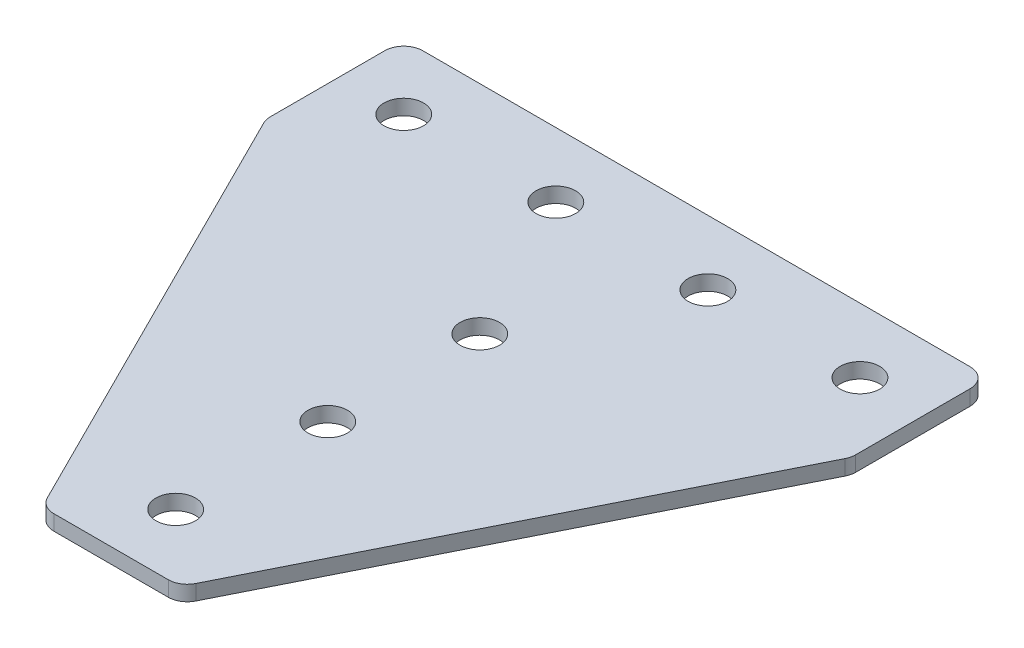
ISO-10303-21;
HEADER;
FILE_DESCRIPTION(('STEP AP214'),'2;1');
FILE_NAME('part.step','',(''),(''),'','','');
FILE_SCHEMA(('AUTOMOTIVE_DESIGN { 1 0 10303 214 1 1 1 1 }'));
ENDSEC;
DATA;
#1=APPLICATION_CONTEXT('core data for automotive mechanical design processes');
#2=APPLICATION_PROTOCOL_DEFINITION('international standard','automotive_design',2000,#1);
#3=PRODUCT_CONTEXT('',#1,'mechanical');
#4=PRODUCT('Part','Part','',(#3));
#5=PRODUCT_RELATED_PRODUCT_CATEGORY('part','',(#4));
#6=PRODUCT_DEFINITION_FORMATION('','',#4);
#7=PRODUCT_DEFINITION_CONTEXT('part definition',#1,'design');
#8=PRODUCT_DEFINITION('design','',#6,#7);
#9=PRODUCT_DEFINITION_SHAPE('','',#8);
#10=(LENGTH_UNIT() NAMED_UNIT(*) SI_UNIT(.MILLI.,.METRE.));
#11=(NAMED_UNIT(*) PLANE_ANGLE_UNIT() SI_UNIT($,.RADIAN.));
#12=(NAMED_UNIT(*) SI_UNIT($,.STERADIAN.) SOLID_ANGLE_UNIT());
#13=UNCERTAINTY_MEASURE_WITH_UNIT(LENGTH_MEASURE(1.E-05),#10,'distance_accuracy_value','');
#14=(GEOMETRIC_REPRESENTATION_CONTEXT(3) GLOBAL_UNCERTAINTY_ASSIGNED_CONTEXT((#13)) GLOBAL_UNIT_ASSIGNED_CONTEXT((#10,
#11,#12)) REPRESENTATION_CONTEXT('',''));
#15=CARTESIAN_POINT('',(0.,0.,0.));
#16=DIRECTION('',(0.,0.,1.));
#17=DIRECTION('',(1.,0.,0.));
#18=AXIS2_PLACEMENT_3D('',#15,#16,#17);
#19=CARTESIAN_POINT('',(-1.5038164553971,1.05807034319605,-30.553919420895));
#20=DIRECTION('',(0.,-1.,0.));
#21=DIRECTION('',(0.,0.,-1.));
#22=AXIS2_PLACEMENT_3D('',#19,#20,#21);
#23=PLANE('',#22);
#24=CARTESIAN_POINT('',(-1.50381645539711,1.05807034319605,-10.553919420895));
#25=DIRECTION('',(0.,1.,0.));
#26=DIRECTION('',(0.,0.,1.));
#27=AXIS2_PLACEMENT_3D('',#24,#25,#26);
#28=CIRCLE('',#27,2.6);
#29=CARTESIAN_POINT('',(-1.50381645539711,1.05807034319605,-7.95391942089496));
#30=VERTEX_POINT('',#29);
#31=EDGE_CURVE('E159',#30,#30,#28,.T.);
#32=ORIENTED_EDGE('',*,*,#31,.T.);
#33=EDGE_LOOP('',(#32));
#34=FACE_BOUND('',#33,.T.);
#35=DIRECTION('',(1.,0.,0.));
#36=VECTOR('',#35,1.);
#37=CARTESIAN_POINT('',(-10.0038164553972,1.05807034319605,37.946080579105));
#38=LINE('',#37,#36);
#39=CARTESIAN_POINT('',(-9.03168050039756,1.05807034319605,37.946080579105));
#40=VERTEX_POINT('',#39);
#41=CARTESIAN_POINT('',(6.02404758960338,1.05807034319605,37.946080579105));
#42=VERTEX_POINT('',#41);
#43=EDGE_CURVE('E170',#40,#42,#38,.T.);
#44=ORIENTED_EDGE('',*,*,#43,.F.);
#45=CARTESIAN_POINT('',(-9.03168050039756,1.05807034319605,35.446080579105));
#46=DIRECTION('',(0.,1.,0.));
#47=DIRECTION('',(0.,0.,-1.));
#48=AXIS2_PLACEMENT_3D('',#45,#46,#47);
#49=CIRCLE('',#48,2.5);
#50=CARTESIAN_POINT('',(-11.2677484778974,1.05807034319605,36.5641145678549));
#51=VERTEX_POINT('',#50);
#52=EDGE_CURVE('E227',#51,#40,#49,.T.);
#53=ORIENTED_EDGE('',*,*,#52,.F.);
#54=DIRECTION('',(-0.447213595499957,0.,-0.894427190999916));
#55=VECTOR('',#54,1.);
#56=CARTESIAN_POINT('',(-10.5767654722723,1.05807034319605,37.946080579105));
#57=LINE('',#56,#55);
#58=CARTESIAN_POINT('',(-39.7398844328968,1.05807034319605,-20.3801573421442));
#59=VERTEX_POINT('',#58);
#60=EDGE_CURVE('E230',#51,#59,#57,.T.);
#61=ORIENTED_EDGE('',*,*,#60,.T.);
#62=CARTESIAN_POINT('',(-37.5038164553971,1.05807034319605,-21.4981913308941));
#63=DIRECTION('',(0.,1.,0.));
#64=DIRECTION('',(0.,0.,-1.));
#65=AXIS2_PLACEMENT_3D('',#62,#63,#64);
#66=CIRCLE('',#65,2.5);
#67=CARTESIAN_POINT('',(-40.0038164553971,1.05807034319605,-21.4981913308941));
#68=VERTEX_POINT('',#67);
#69=EDGE_CURVE('E233',#68,#59,#66,.T.);
#70=ORIENTED_EDGE('',*,*,#69,.F.);
#71=DIRECTION('',(0.,0.,-1.));
#72=VECTOR('',#71,1.);
#73=CARTESIAN_POINT('',(-40.0038164553971,1.05807034319605,-20.9080213871446));
#74=LINE('',#73,#72);
#75=CARTESIAN_POINT('',(-40.003816455397,1.05807034319605,-36.553919420895));
#76=VERTEX_POINT('',#75);
#77=EDGE_CURVE('E130',#68,#76,#74,.T.);
#78=ORIENTED_EDGE('',*,*,#77,.T.);
#79=CARTESIAN_POINT('',(-37.503816455397,1.05807034319605,-36.553919420895));
#80=DIRECTION('',(0.,1.,0.));
#81=DIRECTION('',(0.,0.,-1.));
#82=AXIS2_PLACEMENT_3D('',#79,#80,#81);
#83=CIRCLE('',#82,2.5);
#84=CARTESIAN_POINT('',(-37.503816455397,1.05807034319605,-39.053919420895));
#85=VERTEX_POINT('',#84);
#86=EDGE_CURVE('E239',#85,#76,#83,.T.);
#87=ORIENTED_EDGE('',*,*,#86,.F.);
#88=DIRECTION('',(-1.,0.,0.));
#89=VECTOR('',#88,1.);
#90=CARTESIAN_POINT('',(36.9961835446028,1.05807034319605,-39.053919420895));
#91=LINE('',#90,#89);
#92=CARTESIAN_POINT('',(34.4961835446028,1.05807034319605,-39.053919420895));
#93=VERTEX_POINT('',#92);
#94=EDGE_CURVE('E134',#93,#85,#91,.T.);
#95=ORIENTED_EDGE('',*,*,#94,.F.);
#96=CARTESIAN_POINT('',(34.4961835446028,1.05807034319605,-36.553919420895));
#97=DIRECTION('',(0.,-1.,0.));
#98=DIRECTION('',(0.,0.,-1.));
#99=AXIS2_PLACEMENT_3D('',#96,#97,#98);
#100=CIRCLE('',#99,2.5);
#101=CARTESIAN_POINT('',(36.9961835446028,1.05807034319605,-36.553919420895));
#102=VERTEX_POINT('',#101);
#103=EDGE_CURVE('E191',#93,#102,#100,.T.);
#104=ORIENTED_EDGE('',*,*,#103,.T.);
#105=DIRECTION('',(0.,0.,-1.));
#106=VECTOR('',#105,1.);
#107=CARTESIAN_POINT('',(36.9961835446029,1.05807034319605,-20.9080213871446));
#108=LINE('',#107,#106);
#109=CARTESIAN_POINT('',(36.9961835446029,1.05807034319605,-21.4981913308941));
#110=VERTEX_POINT('',#109);
#111=EDGE_CURVE('E175',#110,#102,#108,.T.);
#112=ORIENTED_EDGE('',*,*,#111,.F.);
#113=CARTESIAN_POINT('',(34.4961835446029,1.05807034319605,-21.4981913308941));
#114=DIRECTION('',(0.,-1.,0.));
#115=DIRECTION('',(0.,0.,-1.));
#116=AXIS2_PLACEMENT_3D('',#113,#114,#115);
#117=CIRCLE('',#116,2.5);
#118=CARTESIAN_POINT('',(36.7322515221026,1.05807034319605,-20.3801573421442));
#119=VERTEX_POINT('',#118);
#120=EDGE_CURVE('E31',#110,#119,#117,.T.);
#121=ORIENTED_EDGE('',*,*,#120,.T.);
#122=DIRECTION('',(0.447213595499957,0.,-0.894427190999916));
#123=VECTOR('',#122,1.);
#124=CARTESIAN_POINT('',(7.56913256147812,1.05807034319605,37.946080579105));
#125=LINE('',#124,#123);
#126=CARTESIAN_POINT('',(8.26011556710317,1.05807034319605,36.5641145678549));
#127=VERTEX_POINT('',#126);
#128=EDGE_CURVE('E173',#127,#119,#125,.T.);
#129=ORIENTED_EDGE('',*,*,#128,.F.);
#130=CARTESIAN_POINT('',(6.02404758960338,1.05807034319605,35.446080579105));
#131=DIRECTION('',(0.,-1.,0.));
#132=DIRECTION('',(0.,0.,-1.));
#133=AXIS2_PLACEMENT_3D('',#130,#131,#132);
#134=CIRCLE('',#133,2.5);
#135=EDGE_CURVE('E194',#127,#42,#134,.T.);
#136=ORIENTED_EDGE('',*,*,#135,.T.);
#137=EDGE_LOOP('',(#44,#53,#61,#70,#78,#87,#95,#104,#112,#121,#129,#136));
#138=FACE_BOUND('',#137,.T.);
#139=CARTESIAN_POINT('',(-1.50381645539711,1.05807034319605,29.446080579105));
#140=DIRECTION('',(0.,1.,0.));
#141=DIRECTION('',(0.,0.,1.));
#142=AXIS2_PLACEMENT_3D('',#139,#140,#141);
#143=CIRCLE('',#142,2.6);
#144=CARTESIAN_POINT('',(-1.50381645539711,1.05807034319605,32.046080579105));
#145=VERTEX_POINT('',#144);
#146=EDGE_CURVE('E147',#145,#145,#143,.T.);
#147=ORIENTED_EDGE('',*,*,#146,.T.);
#148=EDGE_LOOP('',(#147));
#149=FACE_BOUND('',#148,.T.);
#150=CARTESIAN_POINT('',(-1.50381645539711,1.05807034319605,9.44608057910504));
#151=DIRECTION('',(0.,1.,0.));
#152=DIRECTION('',(0.,0.,1.));
#153=AXIS2_PLACEMENT_3D('',#150,#151,#152);
#154=CIRCLE('',#153,2.6);
#155=CARTESIAN_POINT('',(-1.50381645539711,1.05807034319605,12.046080579105));
#156=VERTEX_POINT('',#155);
#157=EDGE_CURVE('E153',#156,#156,#154,.T.);
#158=ORIENTED_EDGE('',*,*,#157,.T.);
#159=EDGE_LOOP('',(#158));
#160=FACE_BOUND('',#159,.T.);
#161=CARTESIAN_POINT('',(28.4961835446029,1.05807034319605,-30.553919420895));
#162=DIRECTION('',(0.,1.,0.));
#163=DIRECTION('',(0.,0.,1.));
#164=AXIS2_PLACEMENT_3D('',#161,#162,#163);
#165=CIRCLE('',#164,2.6);
#166=CARTESIAN_POINT('',(28.4961835446029,1.05807034319605,-27.953919420895));
#167=VERTEX_POINT('',#166);
#168=EDGE_CURVE('E139',#167,#167,#165,.T.);
#169=ORIENTED_EDGE('',*,*,#168,.T.);
#170=EDGE_LOOP('',(#169));
#171=FACE_BOUND('',#170,.T.);
#172=CARTESIAN_POINT('',(8.4961835446029,1.05807034319605,-30.553919420895));
#173=DIRECTION('',(0.,1.,0.));
#174=DIRECTION('',(0.,0.,1.));
#175=AXIS2_PLACEMENT_3D('',#172,#173,#174);
#176=CIRCLE('',#175,2.6);
#177=CARTESIAN_POINT('',(8.4961835446029,1.05807034319605,-27.953919420895));
#178=VERTEX_POINT('',#177);
#179=EDGE_CURVE('E119',#178,#178,#176,.T.);
#180=ORIENTED_EDGE('',*,*,#179,.T.);
#181=EDGE_LOOP('',(#180));
#182=FACE_BOUND('',#181,.T.);
#183=CARTESIAN_POINT('',(-31.5038164553971,1.05807034319605,-30.553919420895));
#184=DIRECTION('',(0.,-1.,0.));
#185=DIRECTION('',(0.,0.,1.));
#186=AXIS2_PLACEMENT_3D('',#183,#184,#185);
#187=CIRCLE('',#186,2.6);
#188=CARTESIAN_POINT('',(-31.5038164553971,1.05807034319605,-27.953919420895));
#189=VERTEX_POINT('',#188);
#190=EDGE_CURVE('E440',#189,#189,#187,.T.);
#191=ORIENTED_EDGE('',*,*,#190,.F.);
#192=EDGE_LOOP('',(#191));
#193=FACE_BOUND('',#192,.T.);
#194=CARTESIAN_POINT('',(-11.5038164553971,1.05807034319605,-30.553919420895));
#195=DIRECTION('',(0.,-1.,0.));
#196=DIRECTION('',(0.,0.,1.));
#197=AXIS2_PLACEMENT_3D('',#194,#195,#196);
#198=CIRCLE('',#197,2.6);
#199=CARTESIAN_POINT('',(-11.5038164553971,1.05807034319605,-27.953919420895));
#200=VERTEX_POINT('',#199);
#201=EDGE_CURVE('E260',#200,#200,#198,.T.);
#202=ORIENTED_EDGE('',*,*,#201,.F.);
#203=EDGE_LOOP('',(#202));
#204=FACE_BOUND('',#203,.T.);
#205=ADVANCED_FACE('F16',(#34,#138,#149,#160,#171,#182,#193,#204),#23,.T.);
#206=CARTESIAN_POINT('',(36.9961835446028,1.05807034319605,-39.053919420895));
#207=DIRECTION('',(0.,0.,-1.));
#208=DIRECTION('',(-1.,0.,0.));
#209=AXIS2_PLACEMENT_3D('',#206,#207,#208);
#210=PLANE('',#209);
#211=ORIENTED_EDGE('',*,*,#94,.T.);
#212=DIRECTION('',(0.,1.,0.));
#213=VECTOR('',#212,1.);
#214=CARTESIAN_POINT('',(-37.503816455397,1.05807034319605,-39.053919420895));
#215=LINE('',#214,#213);
#216=CARTESIAN_POINT('',(-37.503816455397,3.05807034319605,-39.053919420895));
#217=VERTEX_POINT('',#216);
#218=EDGE_CURVE('E125',#217,#85,#215,.F.);
#219=ORIENTED_EDGE('',*,*,#218,.F.);
#220=DIRECTION('',(-1.,0.,0.));
#221=VECTOR('',#220,1.);
#222=CARTESIAN_POINT('',(36.9961835446028,3.05807034319605,-39.053919420895));
#223=LINE('',#222,#221);
#224=CARTESIAN_POINT('',(34.4961835446028,3.05807034319605,-39.053919420895));
#225=VERTEX_POINT('',#224);
#226=EDGE_CURVE('E105',#225,#217,#223,.T.);
#227=ORIENTED_EDGE('',*,*,#226,.F.);
#228=DIRECTION('',(0.,1.,0.));
#229=VECTOR('',#228,1.);
#230=CARTESIAN_POINT('',(34.4961835446028,1.05807034319605,-39.053919420895));
#231=LINE('',#230,#229);
#232=EDGE_CURVE('E10',#225,#93,#231,.F.);
#233=ORIENTED_EDGE('',*,*,#232,.T.);
#234=EDGE_LOOP('',(#211,#219,#227,#233));
#235=FACE_BOUND('',#234,.T.);
#236=ADVANCED_FACE('F132',(#235),#210,.T.);
#237=CARTESIAN_POINT('',(36.9961835446029,1.05807034319605,-20.9080213871446));
#238=DIRECTION('',(1.,0.,0.));
#239=DIRECTION('',(0.,0.,-1.));
#240=AXIS2_PLACEMENT_3D('',#237,#238,#239);
#241=PLANE('',#240);
#242=DIRECTION('',(0.,0.,-1.));
#243=VECTOR('',#242,1.);
#244=CARTESIAN_POINT('',(36.9961835446029,3.05807034319605,-20.9080213871446));
#245=LINE('',#244,#243);
#246=CARTESIAN_POINT('',(36.9961835446029,3.05807034319605,-21.4981913308941));
#247=VERTEX_POINT('',#246);
#248=CARTESIAN_POINT('',(36.9961835446028,3.05807034319605,-36.553919420895));
#249=VERTEX_POINT('',#248);
#250=EDGE_CURVE('E171',#247,#249,#245,.T.);
#251=ORIENTED_EDGE('',*,*,#250,.F.);
#252=DIRECTION('',(0.,1.,0.));
#253=VECTOR('',#252,1.);
#254=CARTESIAN_POINT('',(36.9961835446029,1.05807034319605,-21.4981913308941));
#255=LINE('',#254,#253);
#256=EDGE_CURVE('E24',#247,#110,#255,.F.);
#257=ORIENTED_EDGE('',*,*,#256,.T.);
#258=ORIENTED_EDGE('',*,*,#111,.T.);
#259=DIRECTION('',(0.,1.,0.));
#260=VECTOR('',#259,1.);
#261=CARTESIAN_POINT('',(36.9961835446028,1.05807034319605,-36.553919420895));
#262=LINE('',#261,#260);
#263=EDGE_CURVE('E201',#102,#249,#262,.T.);
#264=ORIENTED_EDGE('',*,*,#263,.T.);
#265=EDGE_LOOP('',(#251,#257,#258,#264));
#266=FACE_BOUND('',#265,.T.);
#267=ADVANCED_FACE('F206',(#266),#241,.T.);
#268=CARTESIAN_POINT('',(7.56913256147812,1.05807034319605,37.946080579105));
#269=DIRECTION('',(0.894427190999916,0.,0.447213595499957));
#270=DIRECTION('',(0.447213595499957,0.,-0.894427190999916));
#271=AXIS2_PLACEMENT_3D('',#268,#269,#270);
#272=PLANE('',#271);
#273=DIRECTION('',(0.447213595499957,0.,-0.894427190999916));
#274=VECTOR('',#273,1.);
#275=CARTESIAN_POINT('',(7.56913256147812,3.05807034319605,37.946080579105));
#276=LINE('',#275,#274);
#277=CARTESIAN_POINT('',(8.26011556710317,3.05807034319605,36.5641145678549));
#278=VERTEX_POINT('',#277);
#279=CARTESIAN_POINT('',(36.7322515221026,3.05807034319605,-20.3801573421442));
#280=VERTEX_POINT('',#279);
#281=EDGE_CURVE('E179',#278,#280,#276,.T.);
#282=ORIENTED_EDGE('',*,*,#281,.F.);
#283=DIRECTION('',(0.,1.,0.));
#284=VECTOR('',#283,1.);
#285=CARTESIAN_POINT('',(8.26011556710317,1.05807034319605,36.5641145678549));
#286=LINE('',#285,#284);
#287=EDGE_CURVE('E38',#278,#127,#286,.F.);
#288=ORIENTED_EDGE('',*,*,#287,.T.);
#289=ORIENTED_EDGE('',*,*,#128,.T.);
#290=DIRECTION('',(0.,1.,0.));
#291=VECTOR('',#290,1.);
#292=CARTESIAN_POINT('',(36.7322515221026,1.05807034319605,-20.3801573421442));
#293=LINE('',#292,#291);
#294=EDGE_CURVE('E197',#119,#280,#293,.T.);
#295=ORIENTED_EDGE('',*,*,#294,.T.);
#296=EDGE_LOOP('',(#282,#288,#289,#295));
#297=FACE_BOUND('',#296,.T.);
#298=ADVANCED_FACE('F213',(#297),#272,.T.);
#299=CARTESIAN_POINT('',(-10.0038164553972,1.05807034319605,37.946080579105));
#300=DIRECTION('',(0.,0.,1.));
#301=DIRECTION('',(1.,0.,0.));
#302=AXIS2_PLACEMENT_3D('',#299,#300,#301);
#303=PLANE('',#302);
#304=DIRECTION('',(1.,0.,0.));
#305=VECTOR('',#304,1.);
#306=CARTESIAN_POINT('',(-10.0038164553972,3.05807034319605,37.946080579105));
#307=LINE('',#306,#305);
#308=CARTESIAN_POINT('',(-9.03168050039756,3.05807034319605,37.946080579105));
#309=VERTEX_POINT('',#308);
#310=CARTESIAN_POINT('',(6.02404758960338,3.05807034319605,37.946080579105));
#311=VERTEX_POINT('',#310);
#312=EDGE_CURVE('E118',#309,#311,#307,.T.);
#313=ORIENTED_EDGE('',*,*,#312,.F.);
#314=DIRECTION('',(0.,1.,0.));
#315=VECTOR('',#314,1.);
#316=CARTESIAN_POINT('',(-9.03168050039756,1.05807034319605,37.946080579105));
#317=LINE('',#316,#315);
#318=EDGE_CURVE('E223',#40,#309,#317,.T.);
#319=ORIENTED_EDGE('',*,*,#318,.F.);
#320=ORIENTED_EDGE('',*,*,#43,.T.);
#321=DIRECTION('',(0.,1.,0.));
#322=VECTOR('',#321,1.);
#323=CARTESIAN_POINT('',(6.02404758960338,1.05807034319605,37.946080579105));
#324=LINE('',#323,#322);
#325=EDGE_CURVE('E188',#42,#311,#324,.T.);
#326=ORIENTED_EDGE('',*,*,#325,.T.);
#327=EDGE_LOOP('',(#313,#319,#320,#326));
#328=FACE_BOUND('',#327,.T.);
#329=ADVANCED_FACE('F220',(#328),#303,.T.);
#330=CARTESIAN_POINT('',(-1.5038164553971,3.05807034319605,-30.553919420895));
#331=DIRECTION('',(0.,-1.,0.));
#332=DIRECTION('',(0.,0.,-1.));
#333=AXIS2_PLACEMENT_3D('',#330,#331,#332);
#334=PLANE('',#333);
#335=CARTESIAN_POINT('',(-1.50381645539711,3.05807034319605,-10.553919420895));
#336=DIRECTION('',(0.,1.,0.));
#337=DIRECTION('',(0.,0.,1.));
#338=AXIS2_PLACEMENT_3D('',#335,#336,#337);
#339=CIRCLE('',#338,2.6);
#340=CARTESIAN_POINT('',(-1.50381645539711,3.05807034319605,-7.95391942089496));
#341=VERTEX_POINT('',#340);
#342=EDGE_CURVE('E156',#341,#341,#339,.T.);
#343=ORIENTED_EDGE('',*,*,#342,.F.);
#344=EDGE_LOOP('',(#343));
#345=FACE_BOUND('',#344,.T.);
#346=CARTESIAN_POINT('',(-9.03168050039756,3.05807034319605,35.446080579105));
#347=DIRECTION('',(0.,1.,0.));
#348=DIRECTION('',(0.,0.,-1.));
#349=AXIS2_PLACEMENT_3D('',#346,#347,#348);
#350=CIRCLE('',#349,2.5);
#351=CARTESIAN_POINT('',(-11.2677484778974,3.05807034319605,36.5641145678549));
#352=VERTEX_POINT('',#351);
#353=EDGE_CURVE('E245',#309,#352,#350,.F.);
#354=ORIENTED_EDGE('',*,*,#353,.F.);
#355=ORIENTED_EDGE('',*,*,#312,.T.);
#356=CARTESIAN_POINT('',(6.02404758960338,3.05807034319605,35.446080579105));
#357=DIRECTION('',(0.,-1.,0.));
#358=DIRECTION('',(0.,0.,-1.));
#359=AXIS2_PLACEMENT_3D('',#356,#357,#358);
#360=CIRCLE('',#359,2.5);
#361=EDGE_CURVE('E186',#311,#278,#360,.F.);
#362=ORIENTED_EDGE('',*,*,#361,.T.);
#363=ORIENTED_EDGE('',*,*,#281,.T.);
#364=CARTESIAN_POINT('',(34.4961835446029,3.05807034319605,-21.4981913308941));
#365=DIRECTION('',(0.,-1.,0.));
#366=DIRECTION('',(0.,0.,-1.));
#367=AXIS2_PLACEMENT_3D('',#364,#365,#366);
#368=CIRCLE('',#367,2.5);
#369=EDGE_CURVE('E184',#280,#247,#368,.F.);
#370=ORIENTED_EDGE('',*,*,#369,.T.);
#371=ORIENTED_EDGE('',*,*,#250,.T.);
#372=CARTESIAN_POINT('',(34.4961835446028,3.05807034319605,-36.553919420895));
#373=DIRECTION('',(0.,-1.,0.));
#374=DIRECTION('',(0.,0.,-1.));
#375=AXIS2_PLACEMENT_3D('',#372,#373,#374);
#376=CIRCLE('',#375,2.5);
#377=EDGE_CURVE('E114',#249,#225,#376,.F.);
#378=ORIENTED_EDGE('',*,*,#377,.T.);
#379=ORIENTED_EDGE('',*,*,#226,.T.);
#380=CARTESIAN_POINT('',(-37.503816455397,3.05807034319605,-36.553919420895));
#381=DIRECTION('',(0.,1.,0.));
#382=DIRECTION('',(0.,0.,-1.));
#383=AXIS2_PLACEMENT_3D('',#380,#381,#382);
#384=CIRCLE('',#383,2.5);
#385=CARTESIAN_POINT('',(-40.003816455397,3.05807034319605,-36.553919420895));
#386=VERTEX_POINT('',#385);
#387=EDGE_CURVE('E111',#386,#217,#384,.F.);
#388=ORIENTED_EDGE('',*,*,#387,.F.);
#389=DIRECTION('',(0.,0.,-1.));
#390=VECTOR('',#389,1.);
#391=CARTESIAN_POINT('',(-40.0038164553971,3.05807034319605,-20.9080213871446));
#392=LINE('',#391,#390);
#393=CARTESIAN_POINT('',(-40.0038164553971,3.05807034319605,-21.4981913308941));
#394=VERTEX_POINT('',#393);
#395=EDGE_CURVE('E250',#394,#386,#392,.T.);
#396=ORIENTED_EDGE('',*,*,#395,.F.);
#397=CARTESIAN_POINT('',(-37.5038164553971,3.05807034319605,-21.4981913308941));
#398=DIRECTION('',(0.,1.,0.));
#399=DIRECTION('',(0.,0.,-1.));
#400=AXIS2_PLACEMENT_3D('',#397,#398,#399);
#401=CIRCLE('',#400,2.5);
#402=CARTESIAN_POINT('',(-39.7398844328968,3.05807034319605,-20.3801573421442));
#403=VERTEX_POINT('',#402);
#404=EDGE_CURVE('E129',#403,#394,#401,.F.);
#405=ORIENTED_EDGE('',*,*,#404,.F.);
#406=DIRECTION('',(-0.447213595499957,0.,-0.894427190999916));
#407=VECTOR('',#406,1.);
#408=CARTESIAN_POINT('',(-10.5767654722723,3.05807034319605,37.946080579105));
#409=LINE('',#408,#407);
#410=EDGE_CURVE('E254',#352,#403,#409,.T.);
#411=ORIENTED_EDGE('',*,*,#410,.F.);
#412=EDGE_LOOP('',(#354,#355,#362,#363,#370,#371,#378,#379,#388,#396,#405,#411));
#413=FACE_BOUND('',#412,.T.);
#414=CARTESIAN_POINT('',(-1.50381645539711,3.05807034319605,29.446080579105));
#415=DIRECTION('',(0.,1.,0.));
#416=DIRECTION('',(0.,0.,1.));
#417=AXIS2_PLACEMENT_3D('',#414,#415,#416);
#418=CIRCLE('',#417,2.6);
#419=CARTESIAN_POINT('',(-1.50381645539711,3.05807034319605,32.046080579105));
#420=VERTEX_POINT('',#419);
#421=EDGE_CURVE('E145',#420,#420,#418,.T.);
#422=ORIENTED_EDGE('',*,*,#421,.F.);
#423=EDGE_LOOP('',(#422));
#424=FACE_BOUND('',#423,.T.);
#425=CARTESIAN_POINT('',(28.4961835446029,3.05807034319605,-30.553919420895));
#426=DIRECTION('',(0.,1.,0.));
#427=DIRECTION('',(0.,0.,1.));
#428=AXIS2_PLACEMENT_3D('',#425,#426,#427);
#429=CIRCLE('',#428,2.6);
#430=CARTESIAN_POINT('',(28.4961835446029,3.05807034319605,-27.953919420895));
#431=VERTEX_POINT('',#430);
#432=EDGE_CURVE('E135',#431,#431,#429,.T.);
#433=ORIENTED_EDGE('',*,*,#432,.F.);
#434=EDGE_LOOP('',(#433));
#435=FACE_BOUND('',#434,.T.);
#436=CARTESIAN_POINT('',(-1.50381645539711,3.05807034319605,9.44608057910504));
#437=DIRECTION('',(0.,1.,0.));
#438=DIRECTION('',(0.,0.,1.));
#439=AXIS2_PLACEMENT_3D('',#436,#437,#438);
#440=CIRCLE('',#439,2.6);
#441=CARTESIAN_POINT('',(-1.50381645539711,3.05807034319605,12.046080579105));
#442=VERTEX_POINT('',#441);
#443=EDGE_CURVE('E150',#442,#442,#440,.T.);
#444=ORIENTED_EDGE('',*,*,#443,.F.);
#445=EDGE_LOOP('',(#444));
#446=FACE_BOUND('',#445,.T.);
#447=CARTESIAN_POINT('',(8.4961835446029,3.05807034319605,-30.553919420895));
#448=DIRECTION('',(0.,1.,0.));
#449=DIRECTION('',(0.,0.,1.));
#450=AXIS2_PLACEMENT_3D('',#447,#448,#449);
#451=CIRCLE('',#450,2.6);
#452=CARTESIAN_POINT('',(8.4961835446029,3.05807034319605,-27.953919420895));
#453=VERTEX_POINT('',#452);
#454=EDGE_CURVE('E162',#453,#453,#451,.T.);
#455=ORIENTED_EDGE('',*,*,#454,.F.);
#456=EDGE_LOOP('',(#455));
#457=FACE_BOUND('',#456,.T.);
#458=CARTESIAN_POINT('',(-31.5038164553971,3.05807034319605,-30.553919420895));
#459=DIRECTION('',(0.,-1.,0.));
#460=DIRECTION('',(0.,0.,1.));
#461=AXIS2_PLACEMENT_3D('',#458,#459,#460);
#462=CIRCLE('',#461,2.6);
#463=CARTESIAN_POINT('',(-31.5038164553971,3.05807034319605,-27.953919420895));
#464=VERTEX_POINT('',#463);
#465=EDGE_CURVE('E443',#464,#464,#462,.T.);
#466=ORIENTED_EDGE('',*,*,#465,.T.);
#467=EDGE_LOOP('',(#466));
#468=FACE_BOUND('',#467,.T.);
#469=CARTESIAN_POINT('',(-11.5038164553971,3.05807034319605,-30.553919420895));
#470=DIRECTION('',(0.,-1.,0.));
#471=DIRECTION('',(0.,0.,1.));
#472=AXIS2_PLACEMENT_3D('',#469,#470,#471);
#473=CIRCLE('',#472,2.6);
#474=CARTESIAN_POINT('',(-11.5038164553971,3.05807034319605,-27.953919420895));
#475=VERTEX_POINT('',#474);
#476=EDGE_CURVE('E257',#475,#475,#473,.T.);
#477=ORIENTED_EDGE('',*,*,#476,.T.);
#478=EDGE_LOOP('',(#477));
#479=FACE_BOUND('',#478,.T.);
#480=ADVANCED_FACE('F108',(#345,#413,#424,#435,#446,#457,#468,#479),#334,.F.);
#481=CARTESIAN_POINT('',(6.02404758960338,1.05807034319605,35.446080579105));
#482=DIRECTION('',(0.,1.,0.));
#483=DIRECTION('',(0.,0.,1.));
#484=AXIS2_PLACEMENT_3D('',#481,#482,#483);
#485=CYLINDRICAL_SURFACE('',#484,2.5);
#486=ORIENTED_EDGE('',*,*,#135,.F.);
#487=ORIENTED_EDGE('',*,*,#287,.F.);
#488=ORIENTED_EDGE('',*,*,#361,.F.);
#489=ORIENTED_EDGE('',*,*,#325,.F.);
#490=EDGE_LOOP('',(#486,#487,#488,#489));
#491=FACE_BOUND('',#490,.T.);
#492=ADVANCED_FACE('F218',(#491),#485,.T.);
#493=CARTESIAN_POINT('',(34.4961835446029,1.05807034319605,-21.4981913308941));
#494=DIRECTION('',(0.,1.,0.));
#495=DIRECTION('',(0.,0.,1.));
#496=AXIS2_PLACEMENT_3D('',#493,#494,#495);
#497=CYLINDRICAL_SURFACE('',#496,2.5);
#498=ORIENTED_EDGE('',*,*,#120,.F.);
#499=ORIENTED_EDGE('',*,*,#256,.F.);
#500=ORIENTED_EDGE('',*,*,#369,.F.);
#501=ORIENTED_EDGE('',*,*,#294,.F.);
#502=EDGE_LOOP('',(#498,#499,#500,#501));
#503=FACE_BOUND('',#502,.T.);
#504=ADVANCED_FACE('F212',(#503),#497,.T.);
#505=CARTESIAN_POINT('',(34.4961835446028,1.05807034319605,-36.553919420895));
#506=DIRECTION('',(0.,1.,0.));
#507=DIRECTION('',(0.,0.,1.));
#508=AXIS2_PLACEMENT_3D('',#505,#506,#507);
#509=CYLINDRICAL_SURFACE('',#508,2.5);
#510=ORIENTED_EDGE('',*,*,#103,.F.);
#511=ORIENTED_EDGE('',*,*,#232,.F.);
#512=ORIENTED_EDGE('',*,*,#377,.F.);
#513=ORIENTED_EDGE('',*,*,#263,.F.);
#514=EDGE_LOOP('',(#510,#511,#512,#513));
#515=FACE_BOUND('',#514,.T.);
#516=ADVANCED_FACE('F18',(#515),#509,.T.);
#517=CARTESIAN_POINT('',(8.4961835446029,1.05807034319605,-30.553919420895));
#518=DIRECTION('',(0.,1.,0.));
#519=DIRECTION('',(0.,0.,1.));
#520=AXIS2_PLACEMENT_3D('',#517,#518,#519);
#521=CYLINDRICAL_SURFACE('',#520,2.6);
#522=ORIENTED_EDGE('',*,*,#179,.F.);
#523=EDGE_LOOP('',(#522));
#524=FACE_BOUND('',#523,.T.);
#525=ORIENTED_EDGE('',*,*,#454,.T.);
#526=EDGE_LOOP('',(#525));
#527=FACE_BOUND('',#526,.T.);
#528=ADVANCED_FACE('F294',(#524,#527),#521,.F.);
#529=CARTESIAN_POINT('',(-1.50381645539711,1.05807034319605,-10.553919420895));
#530=DIRECTION('',(0.,1.,0.));
#531=DIRECTION('',(0.,0.,1.));
#532=AXIS2_PLACEMENT_3D('',#529,#530,#531);
#533=CYLINDRICAL_SURFACE('',#532,2.6);
#534=ORIENTED_EDGE('',*,*,#31,.F.);
#535=EDGE_LOOP('',(#534));
#536=FACE_BOUND('',#535,.T.);
#537=ORIENTED_EDGE('',*,*,#342,.T.);
#538=EDGE_LOOP('',(#537));
#539=FACE_BOUND('',#538,.T.);
#540=ADVANCED_FACE('F299',(#536,#539),#533,.F.);
#541=CARTESIAN_POINT('',(-1.50381645539711,1.05807034319605,9.44608057910504));
#542=DIRECTION('',(0.,1.,0.));
#543=DIRECTION('',(0.,0.,1.));
#544=AXIS2_PLACEMENT_3D('',#541,#542,#543);
#545=CYLINDRICAL_SURFACE('',#544,2.6);
#546=ORIENTED_EDGE('',*,*,#443,.T.);
#547=EDGE_LOOP('',(#546));
#548=FACE_BOUND('',#547,.T.);
#549=ORIENTED_EDGE('',*,*,#157,.F.);
#550=EDGE_LOOP('',(#549));
#551=FACE_BOUND('',#550,.T.);
#552=ADVANCED_FACE('F305',(#548,#551),#545,.F.);
#553=CARTESIAN_POINT('',(-1.50381645539711,1.05807034319605,29.446080579105));
#554=DIRECTION('',(0.,1.,0.));
#555=DIRECTION('',(0.,0.,1.));
#556=AXIS2_PLACEMENT_3D('',#553,#554,#555);
#557=CYLINDRICAL_SURFACE('',#556,2.6);
#558=ORIENTED_EDGE('',*,*,#421,.T.);
#559=EDGE_LOOP('',(#558));
#560=FACE_BOUND('',#559,.T.);
#561=ORIENTED_EDGE('',*,*,#146,.F.);
#562=EDGE_LOOP('',(#561));
#563=FACE_BOUND('',#562,.T.);
#564=ADVANCED_FACE('F361',(#560,#563),#557,.F.);
#565=CARTESIAN_POINT('',(28.4961835446029,1.05807034319605,-30.553919420895));
#566=DIRECTION('',(0.,1.,0.));
#567=DIRECTION('',(0.,0.,1.));
#568=AXIS2_PLACEMENT_3D('',#565,#566,#567);
#569=CYLINDRICAL_SURFACE('',#568,2.6);
#570=ORIENTED_EDGE('',*,*,#168,.F.);
#571=EDGE_LOOP('',(#570));
#572=FACE_BOUND('',#571,.T.);
#573=ORIENTED_EDGE('',*,*,#432,.T.);
#574=EDGE_LOOP('',(#573));
#575=FACE_BOUND('',#574,.T.);
#576=ADVANCED_FACE('F370',(#572,#575),#569,.F.);
#577=CARTESIAN_POINT('',(-40.0038164553971,1.05807034319605,-20.9080213871446));
#578=DIRECTION('',(-1.,0.,0.));
#579=DIRECTION('',(0.,0.,-1.));
#580=AXIS2_PLACEMENT_3D('',#577,#578,#579);
#581=PLANE('',#580);
#582=ORIENTED_EDGE('',*,*,#395,.T.);
#583=DIRECTION('',(0.,1.,0.));
#584=VECTOR('',#583,1.);
#585=CARTESIAN_POINT('',(-40.003816455397,1.05807034319605,-36.553919420895));
#586=LINE('',#585,#584);
#587=EDGE_CURVE('E127',#76,#386,#586,.T.);
#588=ORIENTED_EDGE('',*,*,#587,.F.);
#589=ORIENTED_EDGE('',*,*,#77,.F.);
#590=DIRECTION('',(0.,1.,0.));
#591=VECTOR('',#590,1.);
#592=CARTESIAN_POINT('',(-40.0038164553971,1.05807034319605,-21.4981913308941));
#593=LINE('',#592,#591);
#594=EDGE_CURVE('E136',#394,#68,#593,.F.);
#595=ORIENTED_EDGE('',*,*,#594,.F.);
#596=EDGE_LOOP('',(#582,#588,#589,#595));
#597=FACE_BOUND('',#596,.T.);
#598=ADVANCED_FACE('F267',(#597),#581,.T.);
#599=CARTESIAN_POINT('',(-10.5767654722723,1.05807034319605,37.946080579105));
#600=DIRECTION('',(-0.894427190999916,0.,0.447213595499957));
#601=DIRECTION('',(-0.447213595499957,0.,-0.894427190999916));
#602=AXIS2_PLACEMENT_3D('',#599,#600,#601);
#603=PLANE('',#602);
#604=ORIENTED_EDGE('',*,*,#410,.T.);
#605=DIRECTION('',(0.,1.,0.));
#606=VECTOR('',#605,1.);
#607=CARTESIAN_POINT('',(-39.7398844328968,1.05807034319605,-20.3801573421442));
#608=LINE('',#607,#606);
#609=EDGE_CURVE('E232',#59,#403,#608,.T.);
#610=ORIENTED_EDGE('',*,*,#609,.F.);
#611=ORIENTED_EDGE('',*,*,#60,.F.);
#612=DIRECTION('',(0.,1.,0.));
#613=VECTOR('',#612,1.);
#614=CARTESIAN_POINT('',(-11.2677484778974,1.05807034319605,36.5641145678549));
#615=LINE('',#614,#613);
#616=EDGE_CURVE('E236',#352,#51,#615,.F.);
#617=ORIENTED_EDGE('',*,*,#616,.F.);
#618=EDGE_LOOP('',(#604,#610,#611,#617));
#619=FACE_BOUND('',#618,.T.);
#620=ADVANCED_FACE('F249',(#619),#603,.T.);
#621=CARTESIAN_POINT('',(-9.03168050039756,1.05807034319605,35.446080579105));
#622=DIRECTION('',(0.,1.,0.));
#623=DIRECTION('',(0.,0.,1.));
#624=AXIS2_PLACEMENT_3D('',#621,#622,#623);
#625=CYLINDRICAL_SURFACE('',#624,2.5);
#626=ORIENTED_EDGE('',*,*,#52,.T.);
#627=ORIENTED_EDGE('',*,*,#318,.T.);
#628=ORIENTED_EDGE('',*,*,#353,.T.);
#629=ORIENTED_EDGE('',*,*,#616,.T.);
#630=EDGE_LOOP('',(#626,#627,#628,#629));
#631=FACE_BOUND('',#630,.T.);
#632=ADVANCED_FACE('F244',(#631),#625,.T.);
#633=CARTESIAN_POINT('',(-37.5038164553971,1.05807034319605,-21.4981913308941));
#634=DIRECTION('',(0.,1.,0.));
#635=DIRECTION('',(0.,0.,1.));
#636=AXIS2_PLACEMENT_3D('',#633,#634,#635);
#637=CYLINDRICAL_SURFACE('',#636,2.5);
#638=ORIENTED_EDGE('',*,*,#69,.T.);
#639=ORIENTED_EDGE('',*,*,#609,.T.);
#640=ORIENTED_EDGE('',*,*,#404,.T.);
#641=ORIENTED_EDGE('',*,*,#594,.T.);
#642=EDGE_LOOP('',(#638,#639,#640,#641));
#643=FACE_BOUND('',#642,.T.);
#644=ADVANCED_FACE('F269',(#643),#637,.T.);
#645=CARTESIAN_POINT('',(-37.503816455397,1.05807034319605,-36.553919420895));
#646=DIRECTION('',(0.,1.,0.));
#647=DIRECTION('',(0.,0.,1.));
#648=AXIS2_PLACEMENT_3D('',#645,#646,#647);
#649=CYLINDRICAL_SURFACE('',#648,2.5);
#650=ORIENTED_EDGE('',*,*,#86,.T.);
#651=ORIENTED_EDGE('',*,*,#587,.T.);
#652=ORIENTED_EDGE('',*,*,#387,.T.);
#653=ORIENTED_EDGE('',*,*,#218,.T.);
#654=EDGE_LOOP('',(#650,#651,#652,#653));
#655=FACE_BOUND('',#654,.T.);
#656=ADVANCED_FACE('F124',(#655),#649,.T.);
#657=CARTESIAN_POINT('',(-11.5038164553971,1.05807034319605,-30.553919420895));
#658=DIRECTION('',(0.,1.,0.));
#659=DIRECTION('',(0.,0.,1.));
#660=AXIS2_PLACEMENT_3D('',#657,#658,#659);
#661=CYLINDRICAL_SURFACE('',#660,2.6);
#662=ORIENTED_EDGE('',*,*,#201,.T.);
#663=EDGE_LOOP('',(#662));
#664=FACE_BOUND('',#663,.T.);
#665=ORIENTED_EDGE('',*,*,#476,.F.);
#666=EDGE_LOOP('',(#665));
#667=FACE_BOUND('',#666,.T.);
#668=ADVANCED_FACE('F277',(#664,#667),#661,.F.);
#669=CARTESIAN_POINT('',(-31.5038164553971,1.05807034319605,-30.553919420895));
#670=DIRECTION('',(0.,1.,0.));
#671=DIRECTION('',(0.,0.,1.));
#672=AXIS2_PLACEMENT_3D('',#669,#670,#671);
#673=CYLINDRICAL_SURFACE('',#672,2.6);
#674=ORIENTED_EDGE('',*,*,#190,.T.);
#675=EDGE_LOOP('',(#674));
#676=FACE_BOUND('',#675,.T.);
#677=ORIENTED_EDGE('',*,*,#465,.F.);
#678=EDGE_LOOP('',(#677));
#679=FACE_BOUND('',#678,.T.);
#680=ADVANCED_FACE('F421',(#676,#679),#673,.F.);
#681=CLOSED_SHELL('',(#205,#236,#267,#298,#329,#480,#492,#504,#516,#528,#540,#552,#564,#576,
#598,#620,#632,#644,#656,#668,#680));
#682=MANIFOLD_SOLID_BREP('B1',#681);
#683=ADVANCED_BREP_SHAPE_REPRESENTATION('',(#18,#682),#14);
#684=SHAPE_DEFINITION_REPRESENTATION(#9,#683);
ENDSEC;
END-ISO-10303-21;
